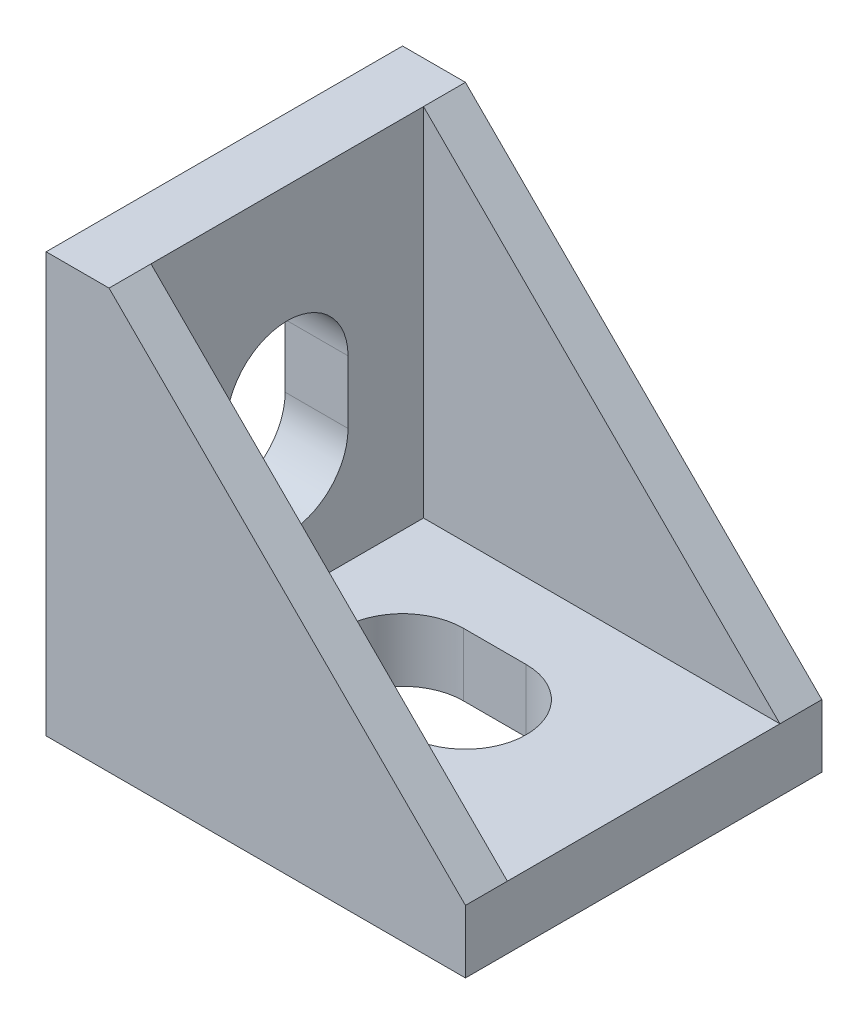
ISO-10303-21;
HEADER;
FILE_DESCRIPTION(('STEP AP214'),'2;1');
FILE_NAME('part.step','',(''),(''),'','','');
FILE_SCHEMA(('AUTOMOTIVE_DESIGN { 1 0 10303 214 1 1 1 1 }'));
ENDSEC;
DATA;
#1=APPLICATION_CONTEXT('core data for automotive mechanical design processes');
#2=APPLICATION_PROTOCOL_DEFINITION('international standard','automotive_design',2000,#1);
#3=PRODUCT_CONTEXT('',#1,'mechanical');
#4=PRODUCT('Part','Part','',(#3));
#5=PRODUCT_RELATED_PRODUCT_CATEGORY('part','',(#4));
#6=PRODUCT_DEFINITION_FORMATION('','',#4);
#7=PRODUCT_DEFINITION_CONTEXT('part definition',#1,'design');
#8=PRODUCT_DEFINITION('design','',#6,#7);
#9=PRODUCT_DEFINITION_SHAPE('','',#8);
#10=(LENGTH_UNIT() NAMED_UNIT(*) SI_UNIT(.MILLI.,.METRE.));
#11=(NAMED_UNIT(*) PLANE_ANGLE_UNIT() SI_UNIT($,.RADIAN.));
#12=(NAMED_UNIT(*) SI_UNIT($,.STERADIAN.) SOLID_ANGLE_UNIT());
#13=UNCERTAINTY_MEASURE_WITH_UNIT(LENGTH_MEASURE(1.E-05),#10,'distance_accuracy_value','');
#14=(GEOMETRIC_REPRESENTATION_CONTEXT(3) GLOBAL_UNCERTAINTY_ASSIGNED_CONTEXT((#13)) GLOBAL_UNIT_ASSIGNED_CONTEXT((#10,
#11,#12)) REPRESENTATION_CONTEXT('',''));
#15=CARTESIAN_POINT('',(0.,0.,0.));
#16=DIRECTION('',(0.,0.,1.));
#17=DIRECTION('',(1.,0.,0.));
#18=AXIS2_PLACEMENT_3D('',#15,#16,#17);
#19=CARTESIAN_POINT('',(0.,0.,8.5));
#20=DIRECTION('',(0.,1.,0.));
#21=DIRECTION('',(0.,0.,1.));
#22=AXIS2_PLACEMENT_3D('',#19,#20,#21);
#23=PLANE('',#22);
#24=DIRECTION('',(-1.,0.,0.));
#25=VECTOR('',#24,1.);
#26=CARTESIAN_POINT('',(1.5,0.,2.));
#27=LINE('',#26,#25);
#28=CARTESIAN_POINT('',(3.34999999999999,0.,2.));
#29=VERTEX_POINT('',#28);
#30=CARTESIAN_POINT('',(1.5,0.,2.));
#31=VERTEX_POINT('',#30);
#32=EDGE_CURVE('E283',#29,#31,#27,.T.);
#33=ORIENTED_EDGE('',*,*,#32,.F.);
#34=DIRECTION('',(0.,0.,-1.));
#35=VECTOR('',#34,1.);
#36=CARTESIAN_POINT('',(3.34999999999999,0.,2.));
#37=LINE('',#36,#35);
#38=CARTESIAN_POINT('',(3.34999999999999,0.,-2.));
#39=VERTEX_POINT('',#38);
#40=EDGE_CURVE('E293',#29,#39,#37,.T.);
#41=ORIENTED_EDGE('',*,*,#40,.T.);
#42=DIRECTION('',(-1.,0.,0.));
#43=VECTOR('',#42,1.);
#44=CARTESIAN_POINT('',(1.5,0.,-2.));
#45=LINE('',#44,#43);
#46=CARTESIAN_POINT('',(1.5,0.,-2.));
#47=VERTEX_POINT('',#46);
#48=EDGE_CURVE('E263',#39,#47,#45,.T.);
#49=ORIENTED_EDGE('',*,*,#48,.T.);
#50=DIRECTION('',(0.,0.,-1.));
#51=VECTOR('',#50,1.);
#52=CARTESIAN_POINT('',(1.5,0.,2.));
#53=LINE('',#52,#51);
#54=EDGE_CURVE('E57',#31,#47,#53,.T.);
#55=ORIENTED_EDGE('',*,*,#54,.F.);
#56=EDGE_LOOP('',(#33,#41,#49,#55));
#57=FACE_BOUND('',#56,.T.);
#58=DIRECTION('',(1.,0.,0.));
#59=VECTOR('',#58,1.);
#60=CARTESIAN_POINT('',(11.5,0.,2.9));
#61=LINE('',#60,#59);
#62=CARTESIAN_POINT('',(8.49999999999996,0.,2.9));
#63=VERTEX_POINT('',#62);
#64=CARTESIAN_POINT('',(11.5,0.,2.9));
#65=VERTEX_POINT('',#64);
#66=EDGE_CURVE('E380',#63,#65,#61,.T.);
#67=ORIENTED_EDGE('',*,*,#66,.T.);
#68=CARTESIAN_POINT('',(11.5,0.,0.));
#69=DIRECTION('',(0.,1.,0.));
#70=DIRECTION('',(-1.,0.,0.));
#71=AXIS2_PLACEMENT_3D('',#68,#69,#70);
#72=CIRCLE('',#71,2.9);
#73=CARTESIAN_POINT('',(11.5,0.,-2.9));
#74=VERTEX_POINT('',#73);
#75=EDGE_CURVE('E370',#65,#74,#72,.T.);
#76=ORIENTED_EDGE('',*,*,#75,.T.);
#77=DIRECTION('',(-1.,0.,0.));
#78=VECTOR('',#77,1.);
#79=CARTESIAN_POINT('',(11.5,0.,-2.9));
#80=LINE('',#79,#78);
#81=CARTESIAN_POINT('',(8.49999999999996,0.,-2.9));
#82=VERTEX_POINT('',#81);
#83=EDGE_CURVE('E373',#74,#82,#80,.T.);
#84=ORIENTED_EDGE('',*,*,#83,.T.);
#85=CARTESIAN_POINT('',(8.49999999999996,0.,0.));
#86=DIRECTION('',(0.,1.,0.));
#87=DIRECTION('',(-1.,0.,0.));
#88=AXIS2_PLACEMENT_3D('',#85,#86,#87);
#89=CIRCLE('',#88,2.9);
#90=EDGE_CURVE('E377',#82,#63,#89,.T.);
#91=ORIENTED_EDGE('',*,*,#90,.T.);
#92=EDGE_LOOP('',(#67,#76,#84,#91));
#93=FACE_BOUND('',#92,.T.);
#94=DIRECTION('',(1.,0.,0.));
#95=VECTOR('',#94,1.);
#96=CARTESIAN_POINT('',(0.,0.,-8.5));
#97=LINE('',#96,#95);
#98=CARTESIAN_POINT('',(0.,0.,-8.5));
#99=VERTEX_POINT('',#98);
#100=CARTESIAN_POINT('',(20.,0.,-8.5));
#101=VERTEX_POINT('',#100);
#102=EDGE_CURVE('E468',#99,#101,#97,.T.);
#103=ORIENTED_EDGE('',*,*,#102,.T.);
#104=DIRECTION('',(0.,0.,-1.));
#105=VECTOR('',#104,1.);
#106=CARTESIAN_POINT('',(20.,0.,8.5));
#107=LINE('',#106,#105);
#108=CARTESIAN_POINT('',(20.,0.,8.5));
#109=VERTEX_POINT('',#108);
#110=EDGE_CURVE('E482',#109,#101,#107,.T.);
#111=ORIENTED_EDGE('',*,*,#110,.F.);
#112=DIRECTION('',(1.,0.,0.));
#113=VECTOR('',#112,1.);
#114=CARTESIAN_POINT('',(0.,0.,8.5));
#115=LINE('',#114,#113);
#116=CARTESIAN_POINT('',(0.,0.,8.5));
#117=VERTEX_POINT('',#116);
#118=EDGE_CURVE('E457',#117,#109,#115,.T.);
#119=ORIENTED_EDGE('',*,*,#118,.F.);
#120=DIRECTION('',(0.,0.,-1.));
#121=VECTOR('',#120,1.);
#122=CARTESIAN_POINT('',(0.,0.,8.5));
#123=LINE('',#122,#121);
#124=EDGE_CURVE('E485',#117,#99,#123,.T.);
#125=ORIENTED_EDGE('',*,*,#124,.T.);
#126=EDGE_LOOP('',(#103,#111,#119,#125));
#127=FACE_BOUND('',#126,.T.);
#128=DIRECTION('',(-1.,0.,0.));
#129=VECTOR('',#128,1.);
#130=CARTESIAN_POINT('',(18.5,0.,2.));
#131=LINE('',#130,#129);
#132=CARTESIAN_POINT('',(18.5,0.,2.));
#133=VERTEX_POINT('',#132);
#134=CARTESIAN_POINT('',(16.65,0.,2.));
#135=VERTEX_POINT('',#134);
#136=EDGE_CURVE('E246',#133,#135,#131,.T.);
#137=ORIENTED_EDGE('',*,*,#136,.F.);
#138=DIRECTION('',(0.,0.,-1.));
#139=VECTOR('',#138,1.);
#140=CARTESIAN_POINT('',(18.5,0.,2.));
#141=LINE('',#140,#139);
#142=CARTESIAN_POINT('',(18.5,0.,-2.));
#143=VERTEX_POINT('',#142);
#144=EDGE_CURVE('E257',#133,#143,#141,.T.);
#145=ORIENTED_EDGE('',*,*,#144,.T.);
#146=DIRECTION('',(-1.,0.,0.));
#147=VECTOR('',#146,1.);
#148=CARTESIAN_POINT('',(18.5,0.,-2.));
#149=LINE('',#148,#147);
#150=CARTESIAN_POINT('',(16.65,0.,-2.));
#151=VERTEX_POINT('',#150);
#152=EDGE_CURVE('E274',#143,#151,#149,.T.);
#153=ORIENTED_EDGE('',*,*,#152,.T.);
#154=DIRECTION('',(0.,0.,-1.));
#155=VECTOR('',#154,1.);
#156=CARTESIAN_POINT('',(16.65,0.,2.));
#157=LINE('',#156,#155);
#158=EDGE_CURVE('E264',#135,#151,#157,.T.);
#159=ORIENTED_EDGE('',*,*,#158,.F.);
#160=EDGE_LOOP('',(#137,#145,#153,#159));
#161=FACE_BOUND('',#160,.T.);
#162=ADVANCED_FACE('F34',(#57,#93,#127,#161),#23,.F.);
#163=CARTESIAN_POINT('',(0.,20.,8.5));
#164=DIRECTION('',(1.,0.,0.));
#165=DIRECTION('',(0.,1.,0.));
#166=AXIS2_PLACEMENT_3D('',#163,#164,#165);
#167=PLANE('',#166);
#168=DIRECTION('',(0.,1.,0.));
#169=VECTOR('',#168,1.);
#170=CARTESIAN_POINT('',(0.,18.5,2.));
#171=LINE('',#170,#169);
#172=CARTESIAN_POINT('',(0.,16.65,2.));
#173=VERTEX_POINT('',#172);
#174=CARTESIAN_POINT('',(0.,18.5,2.));
#175=VERTEX_POINT('',#174);
#176=EDGE_CURVE('E341',#173,#175,#171,.T.);
#177=ORIENTED_EDGE('',*,*,#176,.F.);
#178=DIRECTION('',(0.,0.,-1.));
#179=VECTOR('',#178,1.);
#180=CARTESIAN_POINT('',(0.,16.65,2.));
#181=LINE('',#180,#179);
#182=CARTESIAN_POINT('',(0.,16.65,-2.));
#183=VERTEX_POINT('',#182);
#184=EDGE_CURVE('E351',#173,#183,#181,.T.);
#185=ORIENTED_EDGE('',*,*,#184,.T.);
#186=DIRECTION('',(0.,1.,0.));
#187=VECTOR('',#186,1.);
#188=CARTESIAN_POINT('',(0.,18.5,-2.));
#189=LINE('',#188,#187);
#190=CARTESIAN_POINT('',(0.,18.5,-2.));
#191=VERTEX_POINT('',#190);
#192=EDGE_CURVE('E340',#183,#191,#189,.T.);
#193=ORIENTED_EDGE('',*,*,#192,.T.);
#194=DIRECTION('',(0.,0.,-1.));
#195=VECTOR('',#194,1.);
#196=CARTESIAN_POINT('',(0.,18.5,2.));
#197=LINE('',#196,#195);
#198=EDGE_CURVE('E367',#175,#191,#197,.T.);
#199=ORIENTED_EDGE('',*,*,#198,.F.);
#200=EDGE_LOOP('',(#177,#185,#193,#199));
#201=FACE_BOUND('',#200,.T.);
#202=DIRECTION('',(0.,1.,0.));
#203=VECTOR('',#202,1.);
#204=CARTESIAN_POINT('',(0.,8.50000000000005,2.9));
#205=LINE('',#204,#203);
#206=CARTESIAN_POINT('',(0.,8.50000000000005,2.9));
#207=VERTEX_POINT('',#206);
#208=CARTESIAN_POINT('',(0.,11.5,2.9));
#209=VERTEX_POINT('',#208);
#210=EDGE_CURVE('E403',#207,#209,#205,.T.);
#211=ORIENTED_EDGE('',*,*,#210,.F.);
#212=CARTESIAN_POINT('',(0.,8.50000000000005,0.));
#213=DIRECTION('',(1.,0.,0.));
#214=DIRECTION('',(0.,1.,0.));
#215=AXIS2_PLACEMENT_3D('',#212,#213,#214);
#216=CIRCLE('',#215,2.9);
#217=CARTESIAN_POINT('',(0.,8.50000000000004,-2.9));
#218=VERTEX_POINT('',#217);
#219=EDGE_CURVE('E406',#218,#207,#216,.F.);
#220=ORIENTED_EDGE('',*,*,#219,.F.);
#221=DIRECTION('',(0.,-1.,0.));
#222=VECTOR('',#221,1.);
#223=CARTESIAN_POINT('',(0.,8.50000000000005,-2.9));
#224=LINE('',#223,#222);
#225=CARTESIAN_POINT('',(0.,11.5,-2.9));
#226=VERTEX_POINT('',#225);
#227=EDGE_CURVE('E423',#226,#218,#224,.T.);
#228=ORIENTED_EDGE('',*,*,#227,.F.);
#229=CARTESIAN_POINT('',(0.,11.5,0.));
#230=DIRECTION('',(1.,0.,0.));
#231=DIRECTION('',(0.,1.,0.));
#232=AXIS2_PLACEMENT_3D('',#229,#230,#231);
#233=CIRCLE('',#232,2.9);
#234=EDGE_CURVE('E395',#209,#226,#233,.F.);
#235=ORIENTED_EDGE('',*,*,#234,.F.);
#236=EDGE_LOOP('',(#211,#220,#228,#235));
#237=FACE_BOUND('',#236,.T.);
#238=DIRECTION('',(0.,-1.,0.));
#239=VECTOR('',#238,1.);
#240=CARTESIAN_POINT('',(0.,20.,-8.5));
#241=LINE('',#240,#239);
#242=CARTESIAN_POINT('',(0.,20.,-8.5));
#243=VERTEX_POINT('',#242);
#244=EDGE_CURVE('E466',#243,#99,#241,.T.);
#245=ORIENTED_EDGE('',*,*,#244,.T.);
#246=ORIENTED_EDGE('',*,*,#124,.F.);
#247=DIRECTION('',(0.,-1.,0.));
#248=VECTOR('',#247,1.);
#249=CARTESIAN_POINT('',(0.,20.,8.5));
#250=LINE('',#249,#248);
#251=CARTESIAN_POINT('',(0.,20.,8.5));
#252=VERTEX_POINT('',#251);
#253=EDGE_CURVE('E454',#252,#117,#250,.T.);
#254=ORIENTED_EDGE('',*,*,#253,.F.);
#255=DIRECTION('',(0.,0.,-1.));
#256=VECTOR('',#255,1.);
#257=CARTESIAN_POINT('',(0.,20.,8.5));
#258=LINE('',#257,#256);
#259=EDGE_CURVE('E488',#252,#243,#258,.T.);
#260=ORIENTED_EDGE('',*,*,#259,.T.);
#261=EDGE_LOOP('',(#245,#246,#254,#260));
#262=FACE_BOUND('',#261,.T.);
#263=DIRECTION('',(0.,1.,0.));
#264=VECTOR('',#263,1.);
#265=CARTESIAN_POINT('',(0.,1.5,2.));
#266=LINE('',#265,#264);
#267=CARTESIAN_POINT('',(0.,1.5,2.));
#268=VERTEX_POINT('',#267);
#269=CARTESIAN_POINT('',(0.,3.35,2.));
#270=VERTEX_POINT('',#269);
#271=EDGE_CURVE('E313',#268,#270,#266,.T.);
#272=ORIENTED_EDGE('',*,*,#271,.F.);
#273=DIRECTION('',(0.,0.,-1.));
#274=VECTOR('',#273,1.);
#275=CARTESIAN_POINT('',(0.,1.5,2.));
#276=LINE('',#275,#274);
#277=CARTESIAN_POINT('',(0.,1.5,-2.));
#278=VERTEX_POINT('',#277);
#279=EDGE_CURVE('E337',#268,#278,#276,.T.);
#280=ORIENTED_EDGE('',*,*,#279,.T.);
#281=DIRECTION('',(0.,1.,0.));
#282=VECTOR('',#281,1.);
#283=CARTESIAN_POINT('',(0.,1.5,-2.));
#284=LINE('',#283,#282);
#285=CARTESIAN_POINT('',(0.,3.35,-2.));
#286=VERTEX_POINT('',#285);
#287=EDGE_CURVE('E323',#278,#286,#284,.T.);
#288=ORIENTED_EDGE('',*,*,#287,.T.);
#289=DIRECTION('',(0.,0.,-1.));
#290=VECTOR('',#289,1.);
#291=CARTESIAN_POINT('',(0.,3.35,2.));
#292=LINE('',#291,#290);
#293=EDGE_CURVE('E334',#270,#286,#292,.T.);
#294=ORIENTED_EDGE('',*,*,#293,.F.);
#295=EDGE_LOOP('',(#272,#280,#288,#294));
#296=FACE_BOUND('',#295,.T.);
#297=ADVANCED_FACE('F529',(#201,#237,#262,#296),#167,.F.);
#298=CARTESIAN_POINT('',(20.,3.,8.5));
#299=DIRECTION('',(-0.707106781186547,-0.707106781186547,0.));
#300=DIRECTION('',(0.707106781186548,-0.707106781186548,0.));
#301=AXIS2_PLACEMENT_3D('',#298,#299,#300);
#302=PLANE('',#301);
#303=DIRECTION('',(0.,0.,-1.));
#304=VECTOR('',#303,1.);
#305=CARTESIAN_POINT('',(3.,20.,8.5));
#306=LINE('',#305,#304);
#307=CARTESIAN_POINT('',(3.,20.,-6.5));
#308=VERTEX_POINT('',#307);
#309=CARTESIAN_POINT('',(3.,20.,-8.5));
#310=VERTEX_POINT('',#309);
#311=EDGE_CURVE('E463',#308,#310,#306,.T.);
#312=ORIENTED_EDGE('',*,*,#311,.F.);
#313=DIRECTION('',(0.707106781186548,-0.707106781186548,0.));
#314=VECTOR('',#313,1.);
#315=CARTESIAN_POINT('',(20.,3.,-6.5));
#316=LINE('',#315,#314);
#317=CARTESIAN_POINT('',(20.,2.99999999999995,-6.5));
#318=VERTEX_POINT('',#317);
#319=EDGE_CURVE('E11',#308,#318,#316,.T.);
#320=ORIENTED_EDGE('',*,*,#319,.T.);
#321=DIRECTION('',(0.,0.,-1.));
#322=VECTOR('',#321,1.);
#323=CARTESIAN_POINT('',(20.,3.,8.5));
#324=LINE('',#323,#322);
#325=CARTESIAN_POINT('',(20.,3.,-8.5));
#326=VERTEX_POINT('',#325);
#327=EDGE_CURVE('E478',#318,#326,#324,.T.);
#328=ORIENTED_EDGE('',*,*,#327,.T.);
#329=DIRECTION('',(-0.707106781186548,0.707106781186548,0.));
#330=VECTOR('',#329,1.);
#331=CARTESIAN_POINT('',(20.,3.,-8.5));
#332=LINE('',#331,#330);
#333=EDGE_CURVE('E455',#326,#310,#332,.T.);
#334=ORIENTED_EDGE('',*,*,#333,.T.);
#335=EDGE_LOOP('',(#312,#320,#328,#334));
#336=FACE_BOUND('',#335,.T.);
#337=ADVANCED_FACE('F521',(#336),#302,.F.);
#338=CARTESIAN_POINT('',(3.,20.,8.5));
#339=DIRECTION('',(0.,-1.,0.));
#340=DIRECTION('',(1.,0.,0.));
#341=AXIS2_PLACEMENT_3D('',#338,#339,#340);
#342=PLANE('',#341);
#343=DIRECTION('',(-1.,0.,0.));
#344=VECTOR('',#343,1.);
#345=CARTESIAN_POINT('',(3.,20.,-8.5));
#346=LINE('',#345,#344);
#347=EDGE_CURVE('E449',#310,#243,#346,.T.);
#348=ORIENTED_EDGE('',*,*,#347,.T.);
#349=ORIENTED_EDGE('',*,*,#259,.F.);
#350=DIRECTION('',(-1.,0.,0.));
#351=VECTOR('',#350,1.);
#352=CARTESIAN_POINT('',(3.,20.,8.5));
#353=LINE('',#352,#351);
#354=CARTESIAN_POINT('',(3.,20.,8.5));
#355=VERTEX_POINT('',#354);
#356=EDGE_CURVE('E451',#355,#252,#353,.T.);
#357=ORIENTED_EDGE('',*,*,#356,.F.);
#358=CARTESIAN_POINT('',(3.,20.,6.5));
#359=VERTEX_POINT('',#358);
#360=EDGE_CURVE('E475',#355,#359,#306,.T.);
#361=ORIENTED_EDGE('',*,*,#360,.T.);
#362=DIRECTION('',(0.,0.,1.));
#363=VECTOR('',#362,1.);
#364=CARTESIAN_POINT('',(3.,20.,-6.5));
#365=LINE('',#364,#363);
#366=EDGE_CURVE('E432',#308,#359,#365,.T.);
#367=ORIENTED_EDGE('',*,*,#366,.F.);
#368=ORIENTED_EDGE('',*,*,#311,.T.);
#369=EDGE_LOOP('',(#348,#349,#357,#361,#367,#368));
#370=FACE_BOUND('',#369,.T.);
#371=ADVANCED_FACE('F36',(#370),#342,.F.);
#372=CARTESIAN_POINT('',(20.,0.,8.5));
#373=DIRECTION('',(-1.,0.,0.));
#374=DIRECTION('',(0.,-1.,0.));
#375=AXIS2_PLACEMENT_3D('',#372,#373,#374);
#376=PLANE('',#375);
#377=DIRECTION('',(0.,1.,0.));
#378=VECTOR('',#377,1.);
#379=CARTESIAN_POINT('',(20.,0.,-8.5));
#380=LINE('',#379,#378);
#381=EDGE_CURVE('E470',#101,#326,#380,.T.);
#382=ORIENTED_EDGE('',*,*,#381,.T.);
#383=ORIENTED_EDGE('',*,*,#327,.F.);
#384=DIRECTION('',(0.,0.,-1.));
#385=VECTOR('',#384,1.);
#386=CARTESIAN_POINT('',(20.,2.99999999999995,-6.5));
#387=LINE('',#386,#385);
#388=CARTESIAN_POINT('',(20.,2.99999999999995,6.5));
#389=VERTEX_POINT('',#388);
#390=EDGE_CURVE('E439',#389,#318,#387,.T.);
#391=ORIENTED_EDGE('',*,*,#390,.F.);
#392=CARTESIAN_POINT('',(20.,3.,8.5));
#393=VERTEX_POINT('',#392);
#394=EDGE_CURVE('E479',#393,#389,#324,.T.);
#395=ORIENTED_EDGE('',*,*,#394,.F.);
#396=DIRECTION('',(0.,1.,0.));
#397=VECTOR('',#396,1.);
#398=CARTESIAN_POINT('',(20.,0.,8.5));
#399=LINE('',#398,#397);
#400=EDGE_CURVE('E459',#109,#393,#399,.T.);
#401=ORIENTED_EDGE('',*,*,#400,.F.);
#402=ORIENTED_EDGE('',*,*,#110,.T.);
#403=EDGE_LOOP('',(#382,#383,#391,#395,#401,#402));
#404=FACE_BOUND('',#403,.T.);
#405=ADVANCED_FACE('F510',(#404),#376,.F.);
#406=ORIENTED_EDGE('',*,*,#394,.T.);
#407=DIRECTION('',(-0.707106781186548,0.707106781186548,0.));
#408=VECTOR('',#407,1.);
#409=CARTESIAN_POINT('',(20.,3.,6.5));
#410=LINE('',#409,#408);
#411=EDGE_CURVE('E42',#389,#359,#410,.T.);
#412=ORIENTED_EDGE('',*,*,#411,.T.);
#413=ORIENTED_EDGE('',*,*,#360,.F.);
#414=DIRECTION('',(-0.707106781186548,0.707106781186548,0.));
#415=VECTOR('',#414,1.);
#416=CARTESIAN_POINT('',(20.,3.,8.5));
#417=LINE('',#416,#415);
#418=EDGE_CURVE('E461',#393,#355,#417,.T.);
#419=ORIENTED_EDGE('',*,*,#418,.F.);
#420=EDGE_LOOP('',(#406,#412,#413,#419));
#421=FACE_BOUND('',#420,.T.);
#422=ADVANCED_FACE('F493',(#421),#302,.F.);
#423=CARTESIAN_POINT('',(0.,0.,8.5));
#424=DIRECTION('',(0.,0.,1.));
#425=DIRECTION('',(1.,0.,0.));
#426=AXIS2_PLACEMENT_3D('',#423,#424,#425);
#427=PLANE('',#426);
#428=ORIENTED_EDGE('',*,*,#356,.T.);
#429=ORIENTED_EDGE('',*,*,#253,.T.);
#430=ORIENTED_EDGE('',*,*,#118,.T.);
#431=ORIENTED_EDGE('',*,*,#400,.T.);
#432=ORIENTED_EDGE('',*,*,#418,.T.);
#433=EDGE_LOOP('',(#428,#429,#430,#431,#432));
#434=FACE_BOUND('',#433,.T.);
#435=ADVANCED_FACE('F503',(#434),#427,.T.);
#436=CARTESIAN_POINT('',(0.,0.,-8.5));
#437=DIRECTION('',(0.,0.,1.));
#438=DIRECTION('',(1.,0.,0.));
#439=AXIS2_PLACEMENT_3D('',#436,#437,#438);
#440=PLANE('',#439);
#441=ORIENTED_EDGE('',*,*,#347,.F.);
#442=ORIENTED_EDGE('',*,*,#333,.F.);
#443=ORIENTED_EDGE('',*,*,#381,.F.);
#444=ORIENTED_EDGE('',*,*,#102,.F.);
#445=ORIENTED_EDGE('',*,*,#244,.F.);
#446=EDGE_LOOP('',(#441,#442,#443,#444,#445));
#447=FACE_BOUND('',#446,.T.);
#448=ADVANCED_FACE('F525',(#447),#440,.F.);
#449=CARTESIAN_POINT('',(2.99999999999996,2.99999999999999,-6.5));
#450=DIRECTION('',(0.,0.,-1.));
#451=DIRECTION('',(-1.,0.,0.));
#452=AXIS2_PLACEMENT_3D('',#449,#450,#451);
#453=PLANE('',#452);
#454=DIRECTION('',(0.,1.,0.));
#455=VECTOR('',#454,1.);
#456=CARTESIAN_POINT('',(2.99999999999996,2.99999999999999,-6.5));
#457=LINE('',#456,#455);
#458=CARTESIAN_POINT('',(2.99999999999996,2.99999999999999,-6.5));
#459=VERTEX_POINT('',#458);
#460=EDGE_CURVE('E447',#459,#308,#457,.T.);
#461=ORIENTED_EDGE('',*,*,#460,.F.);
#462=DIRECTION('',(-1.,0.,0.));
#463=VECTOR('',#462,1.);
#464=CARTESIAN_POINT('',(2.99999999999996,2.99999999999999,-6.5));
#465=LINE('',#464,#463);
#466=EDGE_CURVE('E441',#318,#459,#465,.T.);
#467=ORIENTED_EDGE('',*,*,#466,.F.);
#468=ORIENTED_EDGE('',*,*,#319,.F.);
#469=EDGE_LOOP('',(#461,#467,#468));
#470=FACE_BOUND('',#469,.T.);
#471=ADVANCED_FACE('F517',(#470),#453,.F.);
#472=CARTESIAN_POINT('',(2.99999999999996,2.99999999999999,6.5));
#473=DIRECTION('',(0.,0.,1.));
#474=DIRECTION('',(1.,0.,0.));
#475=AXIS2_PLACEMENT_3D('',#472,#473,#474);
#476=PLANE('',#475);
#477=DIRECTION('',(1.,0.,0.));
#478=VECTOR('',#477,1.);
#479=CARTESIAN_POINT('',(2.99999999999996,2.99999999999999,6.5));
#480=LINE('',#479,#478);
#481=CARTESIAN_POINT('',(2.99999999999996,2.99999999999999,6.5));
#482=VERTEX_POINT('',#481);
#483=EDGE_CURVE('E436',#482,#389,#480,.T.);
#484=ORIENTED_EDGE('',*,*,#483,.F.);
#485=DIRECTION('',(0.,1.,0.));
#486=VECTOR('',#485,1.);
#487=CARTESIAN_POINT('',(2.99999999999996,2.99999999999999,6.5));
#488=LINE('',#487,#486);
#489=EDGE_CURVE('E444',#482,#359,#488,.T.);
#490=ORIENTED_EDGE('',*,*,#489,.T.);
#491=ORIENTED_EDGE('',*,*,#411,.F.);
#492=EDGE_LOOP('',(#484,#490,#491));
#493=FACE_BOUND('',#492,.T.);
#494=ADVANCED_FACE('F553',(#493),#476,.F.);
#495=CARTESIAN_POINT('',(2.99999999999996,2.99999999999999,-6.5));
#496=DIRECTION('',(-1.,0.,0.));
#497=DIRECTION('',(0.,-1.,0.));
#498=AXIS2_PLACEMENT_3D('',#495,#496,#497);
#499=PLANE('',#498);
#500=DIRECTION('',(0.,1.,0.));
#501=VECTOR('',#500,1.);
#502=CARTESIAN_POINT('',(2.99999999999998,8.50000000000004,-2.9));
#503=LINE('',#502,#501);
#504=CARTESIAN_POINT('',(2.99999999999998,8.50000000000004,-2.9));
#505=VERTEX_POINT('',#504);
#506=CARTESIAN_POINT('',(2.99999999999998,11.5,-2.9));
#507=VERTEX_POINT('',#506);
#508=EDGE_CURVE('E411',#505,#507,#503,.T.);
#509=ORIENTED_EDGE('',*,*,#508,.F.);
#510=CARTESIAN_POINT('',(2.99999999999998,8.50000000000004,0.));
#511=DIRECTION('',(1.,0.,0.));
#512=DIRECTION('',(0.,1.,0.));
#513=AXIS2_PLACEMENT_3D('',#510,#511,#512);
#514=CIRCLE('',#513,2.9);
#515=CARTESIAN_POINT('',(2.99999999999998,8.50000000000004,2.9));
#516=VERTEX_POINT('',#515);
#517=EDGE_CURVE('E409',#516,#505,#514,.T.);
#518=ORIENTED_EDGE('',*,*,#517,.F.);
#519=DIRECTION('',(0.,-1.,0.));
#520=VECTOR('',#519,1.);
#521=CARTESIAN_POINT('',(2.99999999999998,8.50000000000004,2.9));
#522=LINE('',#521,#520);
#523=CARTESIAN_POINT('',(2.99999999999998,11.5,2.9));
#524=VERTEX_POINT('',#523);
#525=EDGE_CURVE('E417',#524,#516,#522,.T.);
#526=ORIENTED_EDGE('',*,*,#525,.F.);
#527=CARTESIAN_POINT('',(2.99999999999998,11.5,0.));
#528=DIRECTION('',(1.,0.,0.));
#529=DIRECTION('',(0.,1.,0.));
#530=AXIS2_PLACEMENT_3D('',#527,#528,#529);
#531=CIRCLE('',#530,2.9);
#532=EDGE_CURVE('E414',#507,#524,#531,.T.);
#533=ORIENTED_EDGE('',*,*,#532,.F.);
#534=EDGE_LOOP('',(#509,#518,#526,#533));
#535=FACE_BOUND('',#534,.T.);
#536=ORIENTED_EDGE('',*,*,#366,.T.);
#537=ORIENTED_EDGE('',*,*,#489,.F.);
#538=DIRECTION('',(0.,0.,1.));
#539=VECTOR('',#538,1.);
#540=CARTESIAN_POINT('',(2.99999999999996,2.99999999999999,-6.5));
#541=LINE('',#540,#539);
#542=EDGE_CURVE('E433',#459,#482,#541,.T.);
#543=ORIENTED_EDGE('',*,*,#542,.F.);
#544=ORIENTED_EDGE('',*,*,#460,.T.);
#545=EDGE_LOOP('',(#536,#537,#543,#544));
#546=FACE_BOUND('',#545,.T.);
#547=ADVANCED_FACE('F550',(#535,#546),#499,.F.);
#548=CARTESIAN_POINT('',(0.,3.,0.));
#549=DIRECTION('',(0.,1.,0.));
#550=DIRECTION('',(-1.,0.,0.));
#551=AXIS2_PLACEMENT_3D('',#548,#549,#550);
#552=PLANE('',#551);
#553=CARTESIAN_POINT('',(11.5,2.99999999999997,0.));
#554=DIRECTION('',(0.,1.,0.));
#555=DIRECTION('',(-1.,0.,0.));
#556=AXIS2_PLACEMENT_3D('',#553,#554,#555);
#557=CIRCLE('',#556,2.9);
#558=CARTESIAN_POINT('',(11.5,2.99999999999997,2.9));
#559=VERTEX_POINT('',#558);
#560=CARTESIAN_POINT('',(11.5,2.99999999999997,-2.9));
#561=VERTEX_POINT('',#560);
#562=EDGE_CURVE('E369',#559,#561,#557,.T.);
#563=ORIENTED_EDGE('',*,*,#562,.F.);
#564=DIRECTION('',(1.,0.,0.));
#565=VECTOR('',#564,1.);
#566=CARTESIAN_POINT('',(11.5,2.99999999999997,2.9));
#567=LINE('',#566,#565);
#568=CARTESIAN_POINT('',(8.49999999999997,2.99999999999998,2.9));
#569=VERTEX_POINT('',#568);
#570=EDGE_CURVE('E374',#569,#559,#567,.T.);
#571=ORIENTED_EDGE('',*,*,#570,.F.);
#572=CARTESIAN_POINT('',(8.49999999999997,2.99999999999998,0.));
#573=DIRECTION('',(0.,1.,0.));
#574=DIRECTION('',(-1.,0.,0.));
#575=AXIS2_PLACEMENT_3D('',#572,#573,#574);
#576=CIRCLE('',#575,2.9);
#577=CARTESIAN_POINT('',(8.49999999999997,2.99999999999998,-2.9));
#578=VERTEX_POINT('',#577);
#579=EDGE_CURVE('E388',#578,#569,#576,.T.);
#580=ORIENTED_EDGE('',*,*,#579,.F.);
#581=DIRECTION('',(-1.,0.,0.));
#582=VECTOR('',#581,1.);
#583=CARTESIAN_POINT('',(11.5,2.99999999999997,-2.9));
#584=LINE('',#583,#582);
#585=EDGE_CURVE('E385',#561,#578,#584,.T.);
#586=ORIENTED_EDGE('',*,*,#585,.F.);
#587=EDGE_LOOP('',(#563,#571,#580,#586));
#588=FACE_BOUND('',#587,.T.);
#589=ORIENTED_EDGE('',*,*,#542,.T.);
#590=ORIENTED_EDGE('',*,*,#483,.T.);
#591=ORIENTED_EDGE('',*,*,#390,.T.);
#592=ORIENTED_EDGE('',*,*,#466,.T.);
#593=EDGE_LOOP('',(#589,#590,#591,#592));
#594=FACE_BOUND('',#593,.T.);
#595=ADVANCED_FACE('F514',(#588,#594),#552,.T.);
#596=CARTESIAN_POINT('',(-0.00100000000002789,8.50000000000005,0.));
#597=DIRECTION('',(1.,0.,0.));
#598=DIRECTION('',(0.,1.,0.));
#599=AXIS2_PLACEMENT_3D('',#596,#597,#598);
#600=CYLINDRICAL_SURFACE('',#599,2.9);
#601=ORIENTED_EDGE('',*,*,#219,.T.);
#602=DIRECTION('',(1.,0.,0.));
#603=VECTOR('',#602,1.);
#604=CARTESIAN_POINT('',(-0.00100000000002745,8.50000000000005,2.9));
#605=LINE('',#604,#603);
#606=EDGE_CURVE('E421',#207,#516,#605,.T.);
#607=ORIENTED_EDGE('',*,*,#606,.T.);
#608=ORIENTED_EDGE('',*,*,#517,.T.);
#609=DIRECTION('',(1.,0.,0.));
#610=VECTOR('',#609,1.);
#611=CARTESIAN_POINT('',(-0.00100000000002832,8.50000000000005,-2.9));
#612=LINE('',#611,#610);
#613=EDGE_CURVE('E420',#218,#505,#612,.T.);
#614=ORIENTED_EDGE('',*,*,#613,.F.);
#615=EDGE_LOOP('',(#601,#607,#608,#614));
#616=FACE_BOUND('',#615,.T.);
#617=ADVANCED_FACE('F561',(#616),#600,.F.);
#618=CARTESIAN_POINT('',(-0.00100000000002745,8.50000000000005,2.9));
#619=DIRECTION('',(0.,0.,1.));
#620=DIRECTION('',(0.,-1.,0.));
#621=AXIS2_PLACEMENT_3D('',#618,#619,#620);
#622=PLANE('',#621);
#623=ORIENTED_EDGE('',*,*,#210,.T.);
#624=DIRECTION('',(1.,0.,0.));
#625=VECTOR('',#624,1.);
#626=CARTESIAN_POINT('',(-0.00100000000002052,11.5,2.9));
#627=LINE('',#626,#625);
#628=EDGE_CURVE('E424',#209,#524,#627,.T.);
#629=ORIENTED_EDGE('',*,*,#628,.T.);
#630=ORIENTED_EDGE('',*,*,#525,.T.);
#631=ORIENTED_EDGE('',*,*,#606,.F.);
#632=EDGE_LOOP('',(#623,#629,#630,#631));
#633=FACE_BOUND('',#632,.T.);
#634=ADVANCED_FACE('F565',(#633),#622,.F.);
#635=CARTESIAN_POINT('',(-0.00100000000002095,11.5,0.));
#636=DIRECTION('',(1.,0.,0.));
#637=DIRECTION('',(0.,1.,0.));
#638=AXIS2_PLACEMENT_3D('',#635,#636,#637);
#639=CYLINDRICAL_SURFACE('',#638,2.9);
#640=ORIENTED_EDGE('',*,*,#234,.T.);
#641=DIRECTION('',(1.,0.,0.));
#642=VECTOR('',#641,1.);
#643=CARTESIAN_POINT('',(-0.00100000000002138,11.5,-2.9));
#644=LINE('',#643,#642);
#645=EDGE_CURVE('E426',#226,#507,#644,.T.);
#646=ORIENTED_EDGE('',*,*,#645,.T.);
#647=ORIENTED_EDGE('',*,*,#532,.T.);
#648=ORIENTED_EDGE('',*,*,#628,.F.);
#649=EDGE_LOOP('',(#640,#646,#647,#648));
#650=FACE_BOUND('',#649,.T.);
#651=ADVANCED_FACE('F571',(#650),#639,.F.);
#652=CARTESIAN_POINT('',(-0.00100000000002832,8.50000000000005,-2.9));
#653=DIRECTION('',(0.,0.,-1.));
#654=DIRECTION('',(0.,1.,0.));
#655=AXIS2_PLACEMENT_3D('',#652,#653,#654);
#656=PLANE('',#655);
#657=ORIENTED_EDGE('',*,*,#227,.T.);
#658=ORIENTED_EDGE('',*,*,#613,.T.);
#659=ORIENTED_EDGE('',*,*,#508,.T.);
#660=ORIENTED_EDGE('',*,*,#645,.F.);
#661=EDGE_LOOP('',(#657,#658,#659,#660));
#662=FACE_BOUND('',#661,.T.);
#663=ADVANCED_FACE('F567',(#662),#656,.F.);
#664=CARTESIAN_POINT('',(11.5,0.,0.));
#665=DIRECTION('',(0.,1.,0.));
#666=DIRECTION('',(-1.,0.,0.));
#667=AXIS2_PLACEMENT_3D('',#664,#665,#666);
#668=CYLINDRICAL_SURFACE('',#667,2.9);
#669=ORIENTED_EDGE('',*,*,#562,.T.);
#670=DIRECTION('',(0.,1.,0.));
#671=VECTOR('',#670,1.);
#672=CARTESIAN_POINT('',(11.5,0.,-2.9));
#673=LINE('',#672,#671);
#674=EDGE_CURVE('E383',#74,#561,#673,.T.);
#675=ORIENTED_EDGE('',*,*,#674,.F.);
#676=ORIENTED_EDGE('',*,*,#75,.F.);
#677=DIRECTION('',(0.,1.,0.));
#678=VECTOR('',#677,1.);
#679=CARTESIAN_POINT('',(11.5,0.,2.9));
#680=LINE('',#679,#678);
#681=EDGE_CURVE('E393',#65,#559,#680,.T.);
#682=ORIENTED_EDGE('',*,*,#681,.T.);
#683=EDGE_LOOP('',(#669,#675,#676,#682));
#684=FACE_BOUND('',#683,.T.);
#685=ADVANCED_FACE('F570',(#684),#668,.F.);
#686=CARTESIAN_POINT('',(11.5,0.,2.9));
#687=DIRECTION('',(0.,0.,1.));
#688=DIRECTION('',(1.,0.,0.));
#689=AXIS2_PLACEMENT_3D('',#686,#687,#688);
#690=PLANE('',#689);
#691=ORIENTED_EDGE('',*,*,#570,.T.);
#692=ORIENTED_EDGE('',*,*,#681,.F.);
#693=ORIENTED_EDGE('',*,*,#66,.F.);
#694=DIRECTION('',(0.,1.,0.));
#695=VECTOR('',#694,1.);
#696=CARTESIAN_POINT('',(8.49999999999996,0.,2.9));
#697=LINE('',#696,#695);
#698=EDGE_CURVE('E396',#63,#569,#697,.T.);
#699=ORIENTED_EDGE('',*,*,#698,.T.);
#700=EDGE_LOOP('',(#691,#692,#693,#699));
#701=FACE_BOUND('',#700,.T.);
#702=ADVANCED_FACE('F581',(#701),#690,.F.);
#703=CARTESIAN_POINT('',(8.49999999999996,0.,0.));
#704=DIRECTION('',(0.,1.,0.));
#705=DIRECTION('',(-1.,0.,0.));
#706=AXIS2_PLACEMENT_3D('',#703,#704,#705);
#707=CYLINDRICAL_SURFACE('',#706,2.9);
#708=ORIENTED_EDGE('',*,*,#579,.T.);
#709=ORIENTED_EDGE('',*,*,#698,.F.);
#710=ORIENTED_EDGE('',*,*,#90,.F.);
#711=DIRECTION('',(0.,1.,0.));
#712=VECTOR('',#711,1.);
#713=CARTESIAN_POINT('',(8.49999999999996,0.,-2.9));
#714=LINE('',#713,#712);
#715=EDGE_CURVE('E398',#82,#578,#714,.T.);
#716=ORIENTED_EDGE('',*,*,#715,.T.);
#717=EDGE_LOOP('',(#708,#709,#710,#716));
#718=FACE_BOUND('',#717,.T.);
#719=ADVANCED_FACE('F587',(#718),#707,.F.);
#720=CARTESIAN_POINT('',(11.5,0.,-2.9));
#721=DIRECTION('',(0.,0.,-1.));
#722=DIRECTION('',(-1.,0.,0.));
#723=AXIS2_PLACEMENT_3D('',#720,#721,#722);
#724=PLANE('',#723);
#725=ORIENTED_EDGE('',*,*,#585,.T.);
#726=ORIENTED_EDGE('',*,*,#715,.F.);
#727=ORIENTED_EDGE('',*,*,#83,.F.);
#728=ORIENTED_EDGE('',*,*,#674,.T.);
#729=EDGE_LOOP('',(#725,#726,#727,#728));
#730=FACE_BOUND('',#729,.T.);
#731=ADVANCED_FACE('F583',(#730),#724,.F.);
#732=CARTESIAN_POINT('',(0.,18.5,2.));
#733=DIRECTION('',(0.,-1.,0.));
#734=DIRECTION('',(1.,0.,0.));
#735=AXIS2_PLACEMENT_3D('',#732,#733,#734);
#736=PLANE('',#735);
#737=DIRECTION('',(-1.,0.,0.));
#738=VECTOR('',#737,1.);
#739=CARTESIAN_POINT('',(0.,18.5,-2.));
#740=LINE('',#739,#738);
#741=CARTESIAN_POINT('',(-1.,18.5,-2.));
#742=VERTEX_POINT('',#741);
#743=EDGE_CURVE('E354',#191,#742,#740,.T.);
#744=ORIENTED_EDGE('',*,*,#743,.T.);
#745=DIRECTION('',(0.,0.,-1.));
#746=VECTOR('',#745,1.);
#747=CARTESIAN_POINT('',(-1.,18.5,2.));
#748=LINE('',#747,#746);
#749=CARTESIAN_POINT('',(-1.,18.5,2.));
#750=VERTEX_POINT('',#749);
#751=EDGE_CURVE('E364',#750,#742,#748,.T.);
#752=ORIENTED_EDGE('',*,*,#751,.F.);
#753=DIRECTION('',(-1.,0.,0.));
#754=VECTOR('',#753,1.);
#755=CARTESIAN_POINT('',(0.,18.5,2.));
#756=LINE('',#755,#754);
#757=EDGE_CURVE('E344',#175,#750,#756,.T.);
#758=ORIENTED_EDGE('',*,*,#757,.F.);
#759=ORIENTED_EDGE('',*,*,#198,.T.);
#760=EDGE_LOOP('',(#744,#752,#758,#759));
#761=FACE_BOUND('',#760,.T.);
#762=ADVANCED_FACE('F586',(#761),#736,.F.);
#763=CARTESIAN_POINT('',(-1.,18.5,2.));
#764=DIRECTION('',(1.,0.,0.));
#765=DIRECTION('',(0.,1.,0.));
#766=AXIS2_PLACEMENT_3D('',#763,#764,#765);
#767=PLANE('',#766);
#768=DIRECTION('',(0.,-1.,0.));
#769=VECTOR('',#768,1.);
#770=CARTESIAN_POINT('',(-1.,18.5,-2.));
#771=LINE('',#770,#769);
#772=CARTESIAN_POINT('',(-1.,16.65,-2.));
#773=VERTEX_POINT('',#772);
#774=EDGE_CURVE('E356',#742,#773,#771,.T.);
#775=ORIENTED_EDGE('',*,*,#774,.T.);
#776=DIRECTION('',(0.,0.,-1.));
#777=VECTOR('',#776,1.);
#778=CARTESIAN_POINT('',(-1.,16.65,2.));
#779=LINE('',#778,#777);
#780=CARTESIAN_POINT('',(-1.,16.65,2.));
#781=VERTEX_POINT('',#780);
#782=EDGE_CURVE('E361',#781,#773,#779,.T.);
#783=ORIENTED_EDGE('',*,*,#782,.F.);
#784=DIRECTION('',(0.,-1.,0.));
#785=VECTOR('',#784,1.);
#786=CARTESIAN_POINT('',(-1.,18.5,2.));
#787=LINE('',#786,#785);
#788=EDGE_CURVE('E347',#750,#781,#787,.T.);
#789=ORIENTED_EDGE('',*,*,#788,.F.);
#790=ORIENTED_EDGE('',*,*,#751,.T.);
#791=EDGE_LOOP('',(#775,#783,#789,#790));
#792=FACE_BOUND('',#791,.T.);
#793=ADVANCED_FACE('F597',(#792),#767,.F.);
#794=CARTESIAN_POINT('',(0.,16.65,2.));
#795=DIRECTION('',(0.,1.,0.));
#796=DIRECTION('',(0.,0.,1.));
#797=AXIS2_PLACEMENT_3D('',#794,#795,#796);
#798=PLANE('',#797);
#799=DIRECTION('',(1.,0.,0.));
#800=VECTOR('',#799,1.);
#801=CARTESIAN_POINT('',(0.,16.65,-2.));
#802=LINE('',#801,#800);
#803=EDGE_CURVE('E345',#773,#183,#802,.T.);
#804=ORIENTED_EDGE('',*,*,#803,.T.);
#805=ORIENTED_EDGE('',*,*,#184,.F.);
#806=DIRECTION('',(1.,0.,0.));
#807=VECTOR('',#806,1.);
#808=CARTESIAN_POINT('',(0.,16.65,2.));
#809=LINE('',#808,#807);
#810=EDGE_CURVE('E349',#781,#173,#809,.T.);
#811=ORIENTED_EDGE('',*,*,#810,.F.);
#812=ORIENTED_EDGE('',*,*,#782,.T.);
#813=EDGE_LOOP('',(#804,#805,#811,#812));
#814=FACE_BOUND('',#813,.T.);
#815=ADVANCED_FACE('F601',(#814),#798,.F.);
#816=CARTESIAN_POINT('',(0.,0.,2.));
#817=DIRECTION('',(0.,0.,-1.));
#818=DIRECTION('',(-1.,0.,0.));
#819=AXIS2_PLACEMENT_3D('',#816,#817,#818);
#820=PLANE('',#819);
#821=ORIENTED_EDGE('',*,*,#176,.T.);
#822=ORIENTED_EDGE('',*,*,#757,.T.);
#823=ORIENTED_EDGE('',*,*,#788,.T.);
#824=ORIENTED_EDGE('',*,*,#810,.T.);
#825=EDGE_LOOP('',(#821,#822,#823,#824));
#826=FACE_BOUND('',#825,.T.);
#827=ADVANCED_FACE('F605',(#826),#820,.F.);
#828=CARTESIAN_POINT('',(0.,0.,-2.));
#829=DIRECTION('',(0.,0.,-1.));
#830=DIRECTION('',(-1.,0.,0.));
#831=AXIS2_PLACEMENT_3D('',#828,#829,#830);
#832=PLANE('',#831);
#833=ORIENTED_EDGE('',*,*,#192,.F.);
#834=ORIENTED_EDGE('',*,*,#803,.F.);
#835=ORIENTED_EDGE('',*,*,#774,.F.);
#836=ORIENTED_EDGE('',*,*,#743,.F.);
#837=EDGE_LOOP('',(#833,#834,#835,#836));
#838=FACE_BOUND('',#837,.T.);
#839=ADVANCED_FACE('F607',(#838),#832,.T.);
#840=CARTESIAN_POINT('',(0.,1.5,2.));
#841=DIRECTION('',(0.,1.,0.));
#842=DIRECTION('',(-1.,0.,0.));
#843=AXIS2_PLACEMENT_3D('',#840,#841,#842);
#844=PLANE('',#843);
#845=DIRECTION('',(1.,0.,0.));
#846=VECTOR('',#845,1.);
#847=CARTESIAN_POINT('',(0.,1.5,-2.));
#848=LINE('',#847,#846);
#849=CARTESIAN_POINT('',(-0.999999999999998,1.49999999999999,-2.));
#850=VERTEX_POINT('',#849);
#851=EDGE_CURVE('E310',#850,#278,#848,.T.);
#852=ORIENTED_EDGE('',*,*,#851,.T.);
#853=ORIENTED_EDGE('',*,*,#279,.F.);
#854=DIRECTION('',(1.,0.,0.));
#855=VECTOR('',#854,1.);
#856=CARTESIAN_POINT('',(0.,1.5,2.));
#857=LINE('',#856,#855);
#858=CARTESIAN_POINT('',(-0.999999999999998,1.49999999999999,2.));
#859=VERTEX_POINT('',#858);
#860=EDGE_CURVE('E311',#859,#268,#857,.T.);
#861=ORIENTED_EDGE('',*,*,#860,.F.);
#862=DIRECTION('',(0.,0.,-1.));
#863=VECTOR('',#862,1.);
#864=CARTESIAN_POINT('',(-0.999999999999998,1.49999999999999,2.));
#865=LINE('',#864,#863);
#866=EDGE_CURVE('E320',#859,#850,#865,.T.);
#867=ORIENTED_EDGE('',*,*,#866,.T.);
#868=EDGE_LOOP('',(#852,#853,#861,#867));
#869=FACE_BOUND('',#868,.T.);
#870=ADVANCED_FACE('F610',(#869),#844,.F.);
#871=CARTESIAN_POINT('',(0.,3.35,2.));
#872=DIRECTION('',(0.,-1.,0.));
#873=DIRECTION('',(0.,0.,-1.));
#874=AXIS2_PLACEMENT_3D('',#871,#872,#873);
#875=PLANE('',#874);
#876=DIRECTION('',(-1.,0.,0.));
#877=VECTOR('',#876,1.);
#878=CARTESIAN_POINT('',(0.,3.35,-2.));
#879=LINE('',#878,#877);
#880=CARTESIAN_POINT('',(-0.999999999999998,3.35,-2.));
#881=VERTEX_POINT('',#880);
#882=EDGE_CURVE('E326',#286,#881,#879,.T.);
#883=ORIENTED_EDGE('',*,*,#882,.T.);
#884=DIRECTION('',(0.,0.,-1.));
#885=VECTOR('',#884,1.);
#886=CARTESIAN_POINT('',(-0.999999999999998,3.35,2.));
#887=LINE('',#886,#885);
#888=CARTESIAN_POINT('',(-0.999999999999998,3.35,2.));
#889=VERTEX_POINT('',#888);
#890=EDGE_CURVE('E331',#889,#881,#887,.T.);
#891=ORIENTED_EDGE('',*,*,#890,.F.);
#892=DIRECTION('',(-1.,0.,0.));
#893=VECTOR('',#892,1.);
#894=CARTESIAN_POINT('',(0.,3.35,2.));
#895=LINE('',#894,#893);
#896=EDGE_CURVE('E316',#270,#889,#895,.T.);
#897=ORIENTED_EDGE('',*,*,#896,.F.);
#898=ORIENTED_EDGE('',*,*,#293,.T.);
#899=EDGE_LOOP('',(#883,#891,#897,#898));
#900=FACE_BOUND('',#899,.T.);
#901=ADVANCED_FACE('F617',(#900),#875,.F.);
#902=CARTESIAN_POINT('',(-0.999999999999998,1.49999999999999,2.));
#903=DIRECTION('',(1.,0.,0.));
#904=DIRECTION('',(0.,1.,0.));
#905=AXIS2_PLACEMENT_3D('',#902,#903,#904);
#906=PLANE('',#905);
#907=DIRECTION('',(0.,-1.,0.));
#908=VECTOR('',#907,1.);
#909=CARTESIAN_POINT('',(-0.999999999999998,1.49999999999999,-2.));
#910=LINE('',#909,#908);
#911=EDGE_CURVE('E314',#881,#850,#910,.T.);
#912=ORIENTED_EDGE('',*,*,#911,.T.);
#913=ORIENTED_EDGE('',*,*,#866,.F.);
#914=DIRECTION('',(0.,-1.,0.));
#915=VECTOR('',#914,1.);
#916=CARTESIAN_POINT('',(-0.999999999999998,1.49999999999999,2.));
#917=LINE('',#916,#915);
#918=EDGE_CURVE('E318',#889,#859,#917,.T.);
#919=ORIENTED_EDGE('',*,*,#918,.F.);
#920=ORIENTED_EDGE('',*,*,#890,.T.);
#921=EDGE_LOOP('',(#912,#913,#919,#920));
#922=FACE_BOUND('',#921,.T.);
#923=ADVANCED_FACE('F621',(#922),#906,.F.);
#924=CARTESIAN_POINT('',(0.,0.,2.));
#925=DIRECTION('',(0.,0.,-1.));
#926=DIRECTION('',(-1.,0.,0.));
#927=AXIS2_PLACEMENT_3D('',#924,#925,#926);
#928=PLANE('',#927);
#929=ORIENTED_EDGE('',*,*,#860,.T.);
#930=ORIENTED_EDGE('',*,*,#271,.T.);
#931=ORIENTED_EDGE('',*,*,#896,.T.);
#932=ORIENTED_EDGE('',*,*,#918,.T.);
#933=EDGE_LOOP('',(#929,#930,#931,#932));
#934=FACE_BOUND('',#933,.T.);
#935=ADVANCED_FACE('F625',(#934),#928,.F.);
#936=CARTESIAN_POINT('',(0.,0.,-2.));
#937=DIRECTION('',(0.,0.,-1.));
#938=DIRECTION('',(-1.,0.,0.));
#939=AXIS2_PLACEMENT_3D('',#936,#937,#938);
#940=PLANE('',#939);
#941=ORIENTED_EDGE('',*,*,#851,.F.);
#942=ORIENTED_EDGE('',*,*,#911,.F.);
#943=ORIENTED_EDGE('',*,*,#882,.F.);
#944=ORIENTED_EDGE('',*,*,#287,.F.);
#945=EDGE_LOOP('',(#941,#942,#943,#944));
#946=FACE_BOUND('',#945,.T.);
#947=ADVANCED_FACE('F627',(#946),#940,.T.);
#948=CARTESIAN_POINT('',(1.5,0.,2.));
#949=DIRECTION('',(1.,0.,0.));
#950=DIRECTION('',(0.,1.,0.));
#951=AXIS2_PLACEMENT_3D('',#948,#949,#950);
#952=PLANE('',#951);
#953=DIRECTION('',(0.,-1.,0.));
#954=VECTOR('',#953,1.);
#955=CARTESIAN_POINT('',(1.5,0.,-2.));
#956=LINE('',#955,#954);
#957=CARTESIAN_POINT('',(1.5,-0.999999999999991,-2.));
#958=VERTEX_POINT('',#957);
#959=EDGE_CURVE('E296',#47,#958,#956,.T.);
#960=ORIENTED_EDGE('',*,*,#959,.T.);
#961=DIRECTION('',(0.,0.,-1.));
#962=VECTOR('',#961,1.);
#963=CARTESIAN_POINT('',(1.5,-0.999999999999991,2.));
#964=LINE('',#963,#962);
#965=CARTESIAN_POINT('',(1.5,-0.999999999999991,2.));
#966=VERTEX_POINT('',#965);
#967=EDGE_CURVE('E306',#966,#958,#964,.T.);
#968=ORIENTED_EDGE('',*,*,#967,.F.);
#969=DIRECTION('',(0.,-1.,0.));
#970=VECTOR('',#969,1.);
#971=CARTESIAN_POINT('',(1.5,0.,2.));
#972=LINE('',#971,#970);
#973=EDGE_CURVE('E286',#31,#966,#972,.T.);
#974=ORIENTED_EDGE('',*,*,#973,.F.);
#975=ORIENTED_EDGE('',*,*,#54,.T.);
#976=EDGE_LOOP('',(#960,#968,#974,#975));
#977=FACE_BOUND('',#976,.T.);
#978=ADVANCED_FACE('F630',(#977),#952,.F.);
#979=CARTESIAN_POINT('',(1.5,-0.999999999999991,2.));
#980=DIRECTION('',(0.,1.,0.));
#981=DIRECTION('',(-1.,0.,0.));
#982=AXIS2_PLACEMENT_3D('',#979,#980,#981);
#983=PLANE('',#982);
#984=DIRECTION('',(1.,0.,0.));
#985=VECTOR('',#984,1.);
#986=CARTESIAN_POINT('',(1.5,-0.999999999999991,-2.));
#987=LINE('',#986,#985);
#988=CARTESIAN_POINT('',(3.35,-0.999999999999984,-2.));
#989=VERTEX_POINT('',#988);
#990=EDGE_CURVE('E298',#958,#989,#987,.T.);
#991=ORIENTED_EDGE('',*,*,#990,.T.);
#992=DIRECTION('',(0.,0.,-1.));
#993=VECTOR('',#992,1.);
#994=CARTESIAN_POINT('',(3.35,-0.999999999999984,2.));
#995=LINE('',#994,#993);
#996=CARTESIAN_POINT('',(3.35,-0.999999999999984,2.));
#997=VERTEX_POINT('',#996);
#998=EDGE_CURVE('E303',#997,#989,#995,.T.);
#999=ORIENTED_EDGE('',*,*,#998,.F.);
#1000=DIRECTION('',(1.,0.,0.));
#1001=VECTOR('',#1000,1.);
#1002=CARTESIAN_POINT('',(1.5,-0.999999999999991,2.));
#1003=LINE('',#1002,#1001);
#1004=EDGE_CURVE('E289',#966,#997,#1003,.T.);
#1005=ORIENTED_EDGE('',*,*,#1004,.F.);
#1006=ORIENTED_EDGE('',*,*,#967,.T.);
#1007=EDGE_LOOP('',(#991,#999,#1005,#1006));
#1008=FACE_BOUND('',#1007,.T.);
#1009=ADVANCED_FACE('F637',(#1008),#983,.F.);
#1010=CARTESIAN_POINT('',(3.34999999999999,0.,2.));
#1011=DIRECTION('',(-1.,0.,0.));
#1012=DIRECTION('',(0.,-1.,0.));
#1013=AXIS2_PLACEMENT_3D('',#1010,#1011,#1012);
#1014=PLANE('',#1013);
#1015=DIRECTION('',(0.,1.,0.));
#1016=VECTOR('',#1015,1.);
#1017=CARTESIAN_POINT('',(3.34999999999999,0.,-2.));
#1018=LINE('',#1017,#1016);
#1019=EDGE_CURVE('E287',#989,#39,#1018,.T.);
#1020=ORIENTED_EDGE('',*,*,#1019,.T.);
#1021=ORIENTED_EDGE('',*,*,#40,.F.);
#1022=DIRECTION('',(0.,1.,0.));
#1023=VECTOR('',#1022,1.);
#1024=CARTESIAN_POINT('',(3.34999999999999,0.,2.));
#1025=LINE('',#1024,#1023);
#1026=EDGE_CURVE('E291',#997,#29,#1025,.T.);
#1027=ORIENTED_EDGE('',*,*,#1026,.F.);
#1028=ORIENTED_EDGE('',*,*,#998,.T.);
#1029=EDGE_LOOP('',(#1020,#1021,#1027,#1028));
#1030=FACE_BOUND('',#1029,.T.);
#1031=ADVANCED_FACE('F640',(#1030),#1014,.F.);
#1032=CARTESIAN_POINT('',(0.,0.,2.));
#1033=DIRECTION('',(0.,0.,-1.));
#1034=DIRECTION('',(-1.,0.,0.));
#1035=AXIS2_PLACEMENT_3D('',#1032,#1033,#1034);
#1036=PLANE('',#1035);
#1037=ORIENTED_EDGE('',*,*,#32,.T.);
#1038=ORIENTED_EDGE('',*,*,#973,.T.);
#1039=ORIENTED_EDGE('',*,*,#1004,.T.);
#1040=ORIENTED_EDGE('',*,*,#1026,.T.);
#1041=EDGE_LOOP('',(#1037,#1038,#1039,#1040));
#1042=FACE_BOUND('',#1041,.T.);
#1043=ADVANCED_FACE('F644',(#1042),#1036,.F.);
#1044=CARTESIAN_POINT('',(0.,0.,-2.));
#1045=DIRECTION('',(0.,0.,-1.));
#1046=DIRECTION('',(-1.,0.,0.));
#1047=AXIS2_PLACEMENT_3D('',#1044,#1045,#1046);
#1048=PLANE('',#1047);
#1049=ORIENTED_EDGE('',*,*,#48,.F.);
#1050=ORIENTED_EDGE('',*,*,#1019,.F.);
#1051=ORIENTED_EDGE('',*,*,#990,.F.);
#1052=ORIENTED_EDGE('',*,*,#959,.F.);
#1053=EDGE_LOOP('',(#1049,#1050,#1051,#1052));
#1054=FACE_BOUND('',#1053,.T.);
#1055=ADVANCED_FACE('F646',(#1054),#1048,.T.);
#1056=CARTESIAN_POINT('',(18.5,0.,2.));
#1057=DIRECTION('',(-1.,0.,0.));
#1058=DIRECTION('',(0.,-1.,0.));
#1059=AXIS2_PLACEMENT_3D('',#1056,#1057,#1058);
#1060=PLANE('',#1059);
#1061=DIRECTION('',(0.,1.,0.));
#1062=VECTOR('',#1061,1.);
#1063=CARTESIAN_POINT('',(18.5,0.,-2.));
#1064=LINE('',#1063,#1062);
#1065=CARTESIAN_POINT('',(18.5,-0.999999999999928,-2.));
#1066=VERTEX_POINT('',#1065);
#1067=EDGE_CURVE('E260',#1066,#143,#1064,.T.);
#1068=ORIENTED_EDGE('',*,*,#1067,.T.);
#1069=ORIENTED_EDGE('',*,*,#144,.F.);
#1070=DIRECTION('',(0.,1.,0.));
#1071=VECTOR('',#1070,1.);
#1072=CARTESIAN_POINT('',(18.5,0.,2.));
#1073=LINE('',#1072,#1071);
#1074=CARTESIAN_POINT('',(18.5,-0.999999999999928,2.));
#1075=VERTEX_POINT('',#1074);
#1076=EDGE_CURVE('E242',#1075,#133,#1073,.T.);
#1077=ORIENTED_EDGE('',*,*,#1076,.F.);
#1078=DIRECTION('',(0.,0.,-1.));
#1079=VECTOR('',#1078,1.);
#1080=CARTESIAN_POINT('',(18.5,-0.999999999999928,2.));
#1081=LINE('',#1080,#1079);
#1082=EDGE_CURVE('E272',#1075,#1066,#1081,.T.);
#1083=ORIENTED_EDGE('',*,*,#1082,.T.);
#1084=EDGE_LOOP('',(#1068,#1069,#1077,#1083));
#1085=FACE_BOUND('',#1084,.T.);
#1086=ADVANCED_FACE('F258',(#1085),#1060,.F.);
#1087=CARTESIAN_POINT('',(16.65,0.,2.));
#1088=DIRECTION('',(1.,0.,0.));
#1089=DIRECTION('',(0.,1.,0.));
#1090=AXIS2_PLACEMENT_3D('',#1087,#1088,#1089);
#1091=PLANE('',#1090);
#1092=DIRECTION('',(0.,-1.,0.));
#1093=VECTOR('',#1092,1.);
#1094=CARTESIAN_POINT('',(16.65,0.,-2.));
#1095=LINE('',#1094,#1093);
#1096=CARTESIAN_POINT('',(16.65,-0.999999999999935,-2.));
#1097=VERTEX_POINT('',#1096);
#1098=EDGE_CURVE('E49',#151,#1097,#1095,.T.);
#1099=ORIENTED_EDGE('',*,*,#1098,.T.);
#1100=DIRECTION('',(0.,0.,-1.));
#1101=VECTOR('',#1100,1.);
#1102=CARTESIAN_POINT('',(16.65,-0.999999999999935,2.));
#1103=LINE('',#1102,#1101);
#1104=CARTESIAN_POINT('',(16.65,-0.999999999999935,2.));
#1105=VERTEX_POINT('',#1104);
#1106=EDGE_CURVE('E279',#1105,#1097,#1103,.T.);
#1107=ORIENTED_EDGE('',*,*,#1106,.F.);
#1108=DIRECTION('',(0.,-1.,0.));
#1109=VECTOR('',#1108,1.);
#1110=CARTESIAN_POINT('',(16.65,0.,2.));
#1111=LINE('',#1110,#1109);
#1112=EDGE_CURVE('E267',#135,#1105,#1111,.T.);
#1113=ORIENTED_EDGE('',*,*,#1112,.F.);
#1114=ORIENTED_EDGE('',*,*,#158,.T.);
#1115=EDGE_LOOP('',(#1099,#1107,#1113,#1114));
#1116=FACE_BOUND('',#1115,.T.);
#1117=ADVANCED_FACE('F655',(#1116),#1091,.F.);
#1118=CARTESIAN_POINT('',(18.5,-0.999999999999928,2.));
#1119=DIRECTION('',(0.,1.,0.));
#1120=DIRECTION('',(-1.,0.,0.));
#1121=AXIS2_PLACEMENT_3D('',#1118,#1119,#1120);
#1122=PLANE('',#1121);
#1123=DIRECTION('',(1.,0.,0.));
#1124=VECTOR('',#1123,1.);
#1125=CARTESIAN_POINT('',(18.5,-0.999999999999928,-2.));
#1126=LINE('',#1125,#1124);
#1127=EDGE_CURVE('E253',#1097,#1066,#1126,.T.);
#1128=ORIENTED_EDGE('',*,*,#1127,.T.);
#1129=ORIENTED_EDGE('',*,*,#1082,.F.);
#1130=DIRECTION('',(1.,0.,0.));
#1131=VECTOR('',#1130,1.);
#1132=CARTESIAN_POINT('',(18.5,-0.999999999999928,2.));
#1133=LINE('',#1132,#1131);
#1134=EDGE_CURVE('E249',#1105,#1075,#1133,.T.);
#1135=ORIENTED_EDGE('',*,*,#1134,.F.);
#1136=ORIENTED_EDGE('',*,*,#1106,.T.);
#1137=EDGE_LOOP('',(#1128,#1129,#1135,#1136));
#1138=FACE_BOUND('',#1137,.T.);
#1139=ADVANCED_FACE('F658',(#1138),#1122,.F.);
#1140=CARTESIAN_POINT('',(0.,0.,2.));
#1141=DIRECTION('',(0.,0.,-1.));
#1142=DIRECTION('',(-1.,0.,0.));
#1143=AXIS2_PLACEMENT_3D('',#1140,#1141,#1142);
#1144=PLANE('',#1143);
#1145=ORIENTED_EDGE('',*,*,#1076,.T.);
#1146=ORIENTED_EDGE('',*,*,#136,.T.);
#1147=ORIENTED_EDGE('',*,*,#1112,.T.);
#1148=ORIENTED_EDGE('',*,*,#1134,.T.);
#1149=EDGE_LOOP('',(#1145,#1146,#1147,#1148));
#1150=FACE_BOUND('',#1149,.T.);
#1151=ADVANCED_FACE('F244',(#1150),#1144,.F.);
#1152=CARTESIAN_POINT('',(0.,0.,-2.));
#1153=DIRECTION('',(0.,0.,-1.));
#1154=DIRECTION('',(-1.,0.,0.));
#1155=AXIS2_PLACEMENT_3D('',#1152,#1153,#1154);
#1156=PLANE('',#1155);
#1157=ORIENTED_EDGE('',*,*,#1067,.F.);
#1158=ORIENTED_EDGE('',*,*,#1127,.F.);
#1159=ORIENTED_EDGE('',*,*,#1098,.F.);
#1160=ORIENTED_EDGE('',*,*,#152,.F.);
#1161=EDGE_LOOP('',(#1157,#1158,#1159,#1160));
#1162=FACE_BOUND('',#1161,.T.);
#1163=ADVANCED_FACE('F663',(#1162),#1156,.T.);
#1164=CLOSED_SHELL('',(#162,#297,#337,#371,#405,#422,#435,#448,#471,#494,#547,#595,#617,#634,
#651,#663,#685,#702,#719,#731,#762,#793,#815,#827,#839,#870,#901,#923,#935,#947,#978,#1009,
#1031,#1043,#1055,#1086,#1117,#1139,#1151,#1163));
#1165=MANIFOLD_SOLID_BREP('B2',#1164);
#1166=ADVANCED_BREP_SHAPE_REPRESENTATION('',(#18,#1165),#14);
#1167=SHAPE_DEFINITION_REPRESENTATION(#9,#1166);
ENDSEC;
END-ISO-10303-21;
